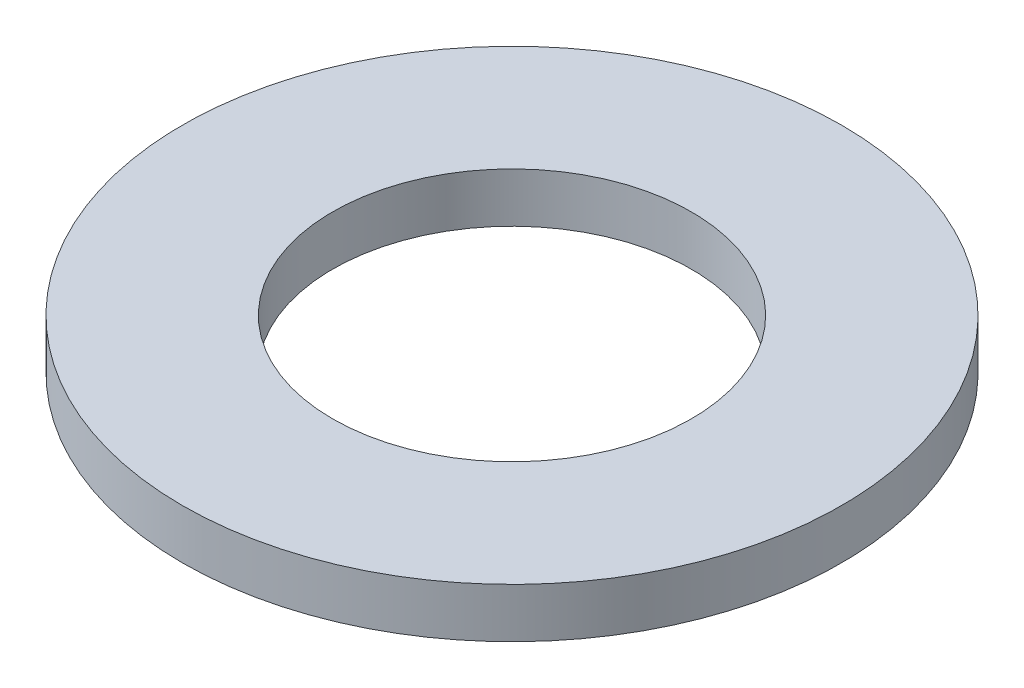
ISO-10303-21;
HEADER;
FILE_DESCRIPTION(('STEP AP214'),'2;1');
FILE_NAME('part.step','',(''),(''),'','','');
FILE_SCHEMA(('AUTOMOTIVE_DESIGN { 1 0 10303 214 1 1 1 1 }'));
ENDSEC;
DATA;
#1=APPLICATION_CONTEXT('core data for automotive mechanical design processes');
#2=APPLICATION_PROTOCOL_DEFINITION('international standard','automotive_design',2000,#1);
#3=PRODUCT_CONTEXT('',#1,'mechanical');
#4=PRODUCT('Part','Part','',(#3));
#5=PRODUCT_RELATED_PRODUCT_CATEGORY('part','',(#4));
#6=PRODUCT_DEFINITION_FORMATION('','',#4);
#7=PRODUCT_DEFINITION_CONTEXT('part definition',#1,'design');
#8=PRODUCT_DEFINITION('design','',#6,#7);
#9=PRODUCT_DEFINITION_SHAPE('','',#8);
#10=(LENGTH_UNIT() NAMED_UNIT(*) SI_UNIT(.MILLI.,.METRE.));
#11=(NAMED_UNIT(*) PLANE_ANGLE_UNIT() SI_UNIT($,.RADIAN.));
#12=(NAMED_UNIT(*) SI_UNIT($,.STERADIAN.) SOLID_ANGLE_UNIT());
#13=UNCERTAINTY_MEASURE_WITH_UNIT(LENGTH_MEASURE(1.E-05),#10,'distance_accuracy_value','');
#14=(GEOMETRIC_REPRESENTATION_CONTEXT(3) GLOBAL_UNCERTAINTY_ASSIGNED_CONTEXT((#13)) GLOBAL_UNIT_ASSIGNED_CONTEXT((#10,
#11,#12)) REPRESENTATION_CONTEXT('',''));
#15=CARTESIAN_POINT('',(0.,0.,0.));
#16=DIRECTION('',(0.,0.,1.));
#17=DIRECTION('',(1.,0.,0.));
#18=AXIS2_PLACEMENT_3D('',#15,#16,#17);
#19=CARTESIAN_POINT('',(0.,0.,0.));
#20=DIRECTION('',(0.,1.,0.));
#21=DIRECTION('',(0.,0.,1.));
#22=AXIS2_PLACEMENT_3D('',#19,#20,#21);
#23=PLANE('',#22);
#24=CARTESIAN_POINT('',(0.,0.,0.));
#25=DIRECTION('',(0.,1.,0.));
#26=DIRECTION('',(0.,0.,1.));
#27=AXIS2_PLACEMENT_3D('',#24,#25,#26);
#28=CIRCLE('',#27,7.3406);
#29=CARTESIAN_POINT('',(0.,0.,7.3406));
#30=VERTEX_POINT('',#29);
#31=EDGE_CURVE('E26',#30,#30,#28,.T.);
#32=ORIENTED_EDGE('',*,*,#31,.T.);
#33=EDGE_LOOP('',(#32));
#34=FACE_BOUND('',#33,.T.);
#35=CARTESIAN_POINT('',(0.,0.,0.));
#36=DIRECTION('',(0.,-1.,0.));
#37=DIRECTION('',(0.,0.,-1.));
#38=AXIS2_PLACEMENT_3D('',#35,#36,#37);
#39=CIRCLE('',#38,13.4874);
#40=CARTESIAN_POINT('',(0.,0.,-13.4874));
#41=VERTEX_POINT('',#40);
#42=EDGE_CURVE('E17',#41,#41,#39,.F.);
#43=ORIENTED_EDGE('',*,*,#42,.F.);
#44=EDGE_LOOP('',(#43));
#45=FACE_BOUND('',#44,.T.);
#46=ADVANCED_FACE('F14',(#34,#45),#23,.F.);
#47=CARTESIAN_POINT('',(0.,2.032,0.));
#48=DIRECTION('',(0.,-1.,0.));
#49=DIRECTION('',(0.,0.,-1.));
#50=AXIS2_PLACEMENT_3D('',#47,#48,#49);
#51=CYLINDRICAL_SURFACE('',#50,13.4874);
#52=CARTESIAN_POINT('',(0.,2.032,0.));
#53=DIRECTION('',(0.,-1.,0.));
#54=DIRECTION('',(0.,0.,-1.));
#55=AXIS2_PLACEMENT_3D('',#52,#53,#54);
#56=CIRCLE('',#55,13.4874);
#57=CARTESIAN_POINT('',(0.,2.032,-13.4874));
#58=VERTEX_POINT('',#57);
#59=EDGE_CURVE('E21',#58,#58,#56,.F.);
#60=ORIENTED_EDGE('',*,*,#59,.F.);
#61=EDGE_LOOP('',(#60));
#62=FACE_BOUND('',#61,.T.);
#63=ORIENTED_EDGE('',*,*,#42,.T.);
#64=EDGE_LOOP('',(#63));
#65=FACE_BOUND('',#64,.T.);
#66=ADVANCED_FACE('F34',(#62,#65),#51,.T.);
#67=CARTESIAN_POINT('',(0.,0.,0.));
#68=DIRECTION('',(0.,1.,0.));
#69=DIRECTION('',(0.,0.,1.));
#70=AXIS2_PLACEMENT_3D('',#67,#68,#69);
#71=CYLINDRICAL_SURFACE('',#70,7.3406);
#72=CARTESIAN_POINT('',(0.,2.032,0.));
#73=DIRECTION('',(0.,1.,0.));
#74=DIRECTION('',(0.,0.,1.));
#75=AXIS2_PLACEMENT_3D('',#72,#73,#74);
#76=CIRCLE('',#75,7.3406);
#77=CARTESIAN_POINT('',(0.,2.032,7.3406));
#78=VERTEX_POINT('',#77);
#79=EDGE_CURVE('E10',#78,#78,#76,.F.);
#80=ORIENTED_EDGE('',*,*,#79,.F.);
#81=EDGE_LOOP('',(#80));
#82=FACE_BOUND('',#81,.T.);
#83=ORIENTED_EDGE('',*,*,#31,.F.);
#84=EDGE_LOOP('',(#83));
#85=FACE_BOUND('',#84,.T.);
#86=ADVANCED_FACE('F41',(#82,#85),#71,.F.);
#87=CARTESIAN_POINT('',(0.,2.032,0.));
#88=DIRECTION('',(0.,1.,0.));
#89=DIRECTION('',(0.,0.,1.));
#90=AXIS2_PLACEMENT_3D('',#87,#88,#89);
#91=PLANE('',#90);
#92=ORIENTED_EDGE('',*,*,#79,.T.);
#93=EDGE_LOOP('',(#92));
#94=FACE_BOUND('',#93,.T.);
#95=ORIENTED_EDGE('',*,*,#59,.T.);
#96=EDGE_LOOP('',(#95));
#97=FACE_BOUND('',#96,.T.);
#98=ADVANCED_FACE('F43',(#94,#97),#91,.T.);
#99=CLOSED_SHELL('',(#46,#66,#86,#98));
#100=MANIFOLD_SOLID_BREP('B1',#99);
#101=ADVANCED_BREP_SHAPE_REPRESENTATION('',(#18,#100),#14);
#102=SHAPE_DEFINITION_REPRESENTATION(#9,#101);
ENDSEC;
END-ISO-10303-21;
